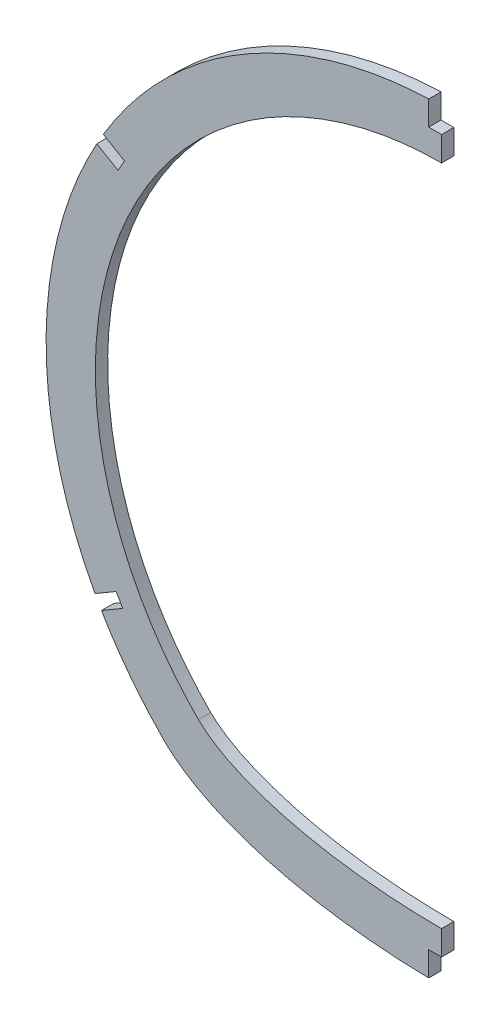
ISO-10303-21;
HEADER;
FILE_DESCRIPTION(('STEP AP214'),'2;1');
FILE_NAME('part.step','',(''),(''),'','','');
FILE_SCHEMA(('AUTOMOTIVE_DESIGN { 1 0 10303 214 1 1 1 1 }'));
ENDSEC;
DATA;
#1=APPLICATION_CONTEXT('core data for automotive mechanical design processes');
#2=APPLICATION_PROTOCOL_DEFINITION('international standard','automotive_design',2000,#1);
#3=PRODUCT_CONTEXT('',#1,'mechanical');
#4=PRODUCT('Part','Part','',(#3));
#5=PRODUCT_RELATED_PRODUCT_CATEGORY('part','',(#4));
#6=PRODUCT_DEFINITION_FORMATION('','',#4);
#7=PRODUCT_DEFINITION_CONTEXT('part definition',#1,'design');
#8=PRODUCT_DEFINITION('design','',#6,#7);
#9=PRODUCT_DEFINITION_SHAPE('','',#8);
#10=(LENGTH_UNIT() NAMED_UNIT(*) SI_UNIT(.MILLI.,.METRE.));
#11=(NAMED_UNIT(*) PLANE_ANGLE_UNIT() SI_UNIT($,.RADIAN.));
#12=(NAMED_UNIT(*) SI_UNIT($,.STERADIAN.) SOLID_ANGLE_UNIT());
#13=UNCERTAINTY_MEASURE_WITH_UNIT(LENGTH_MEASURE(1.E-05),#10,'distance_accuracy_value','');
#14=(GEOMETRIC_REPRESENTATION_CONTEXT(3) GLOBAL_UNCERTAINTY_ASSIGNED_CONTEXT((#13)) GLOBAL_UNIT_ASSIGNED_CONTEXT((#10,
#11,#12)) REPRESENTATION_CONTEXT('',''));
#15=CARTESIAN_POINT('',(0.,0.,0.));
#16=DIRECTION('',(0.,0.,1.));
#17=DIRECTION('',(1.,0.,0.));
#18=AXIS2_PLACEMENT_3D('',#15,#16,#17);
#19=CARTESIAN_POINT('',(49.5009150251778,91.3480347676851,-3.175));
#20=CARTESIAN_POINT('',(49.188310006463,91.524412895684,-3.175));
#21=CARTESIAN_POINT('',(48.5618108473245,91.8735190835381,-3.175));
#22=CARTESIAN_POINT('',(47.6826566420058,92.3513831690175,-3.175));
#23=CARTESIAN_POINT('',(46.7667227464734,92.8378491452977,-3.175));
#24=CARTESIAN_POINT('',(45.8466079607826,93.3142943038686,-3.175));
#25=CARTESIAN_POINT('',(44.9225493041904,93.7809177901616,-3.175));
#26=CARTESIAN_POINT('',(43.994622480106,94.2376340488833,-3.175));
#27=CARTESIAN_POINT('',(42.4432748698963,94.9816093987879,-3.175));
#28=CARTESIAN_POINT('',(39.9429438824299,96.118550992504,-3.175));
#29=CARTESIAN_POINT('',(36.45934876495,97.5551092489247,-3.175));
#30=CARTESIAN_POINT('',(32.6112816617896,98.961940132418,-3.175));
#31=CARTESIAN_POINT('',(28.7241978285818,100.207008268086,-3.175));
#32=CARTESIAN_POINT('',(24.8050353304667,101.289916540101,-3.175));
#33=CARTESIAN_POINT('',(20.8606758926356,102.210568115259,-3.175));
#34=CARTESIAN_POINT('',(16.8979328914549,102.96916021327,-3.175));
#35=CARTESIAN_POINT('',(12.9235364558735,103.566176285235,-3.175));
#36=CARTESIAN_POINT('',(8.94412924921375,104.002381093837,-3.175));
#37=CARTESIAN_POINT('',(5.29592070630354,104.255895367686,-3.175));
#38=CARTESIAN_POINT('',(2.64468898430357,104.347784007784,-3.175));
#39=CARTESIAN_POINT('',(0.991105150160322,104.372307847745,-3.175));
#40=CARTESIAN_POINT('',(-3.65694174832626,104.395312688799,-3.175));
#41=CARTESIAN_POINT('',(-12.0294965627891,103.894248368432,-3.175));
#42=CARTESIAN_POINT('',(-24.000842482084,101.716725173513,-3.175));
#43=CARTESIAN_POINT('',(-35.7904996479663,98.052224226085,-3.175));
#44=CARTESIAN_POINT('',(-47.2020288848494,92.8989668357338,-3.175));
#45=CARTESIAN_POINT('',(-58.6369916032999,85.9148260962418,-3.175));
#46=CARTESIAN_POINT('',(-69.8712448207028,76.755385293212,-3.175));
#47=CARTESIAN_POINT('',(-80.0433671629454,65.5541464838692,-3.175));
#48=CARTESIAN_POINT('',(-88.656512854058,52.7081207513875,-3.175));
#49=CARTESIAN_POINT('',(-94.9477876275601,39.4775915957048,-3.175));
#50=CARTESIAN_POINT('',(-99.5817152647422,24.7033927894236,-3.175));
#51=CARTESIAN_POINT('',(-101.637583470158,11.9166161834522,-3.175));
#52=CARTESIAN_POINT('',(-102.055561508796,1.05564464694755,-3.175));
#53=CARTESIAN_POINT('',(-101.805900705101,-6.10847144893243,-3.175));
#54=CARTESIAN_POINT('',(-101.217383692121,-12.1158216609889,-3.175));
#55=CARTESIAN_POINT('',(-100.4843781062,-16.9734792239715,-3.175));
#56=CARTESIAN_POINT('',(-99.4165681133501,-22.4926511017455,-3.175));
#57=CARTESIAN_POINT('',(-97.8067776153171,-28.8547901922303,-3.175));
#58=CARTESIAN_POINT('',(-95.3516338001493,-36.1751584408927,-3.175));
#59=CARTESIAN_POINT('',(-92.5499221794144,-42.8913874243363,-3.175));
#60=CARTESIAN_POINT('',(-90.1147287382659,-47.7724368106105,-3.175));
#61=CARTESIAN_POINT('',(-88.2859114265374,-51.0701314882498,-3.175));
#62=CARTESIAN_POINT('',(-87.1622182537815,-52.9973355617063,-3.175));
#63=CARTESIAN_POINT('',(-85.6295668087907,-55.5014033934274,-3.175));
#64=CARTESIAN_POINT('',(-83.6416121299898,-58.5296735477416,-3.175));
#65=CARTESIAN_POINT('',(-81.5476082197693,-61.4464285751036,-3.175));
#66=CARTESIAN_POINT('',(-79.8244327389292,-63.6962461401433,-3.175));
#67=CARTESIAN_POINT('',(-78.5156774789072,-65.3347298757925,-3.175));
#68=CARTESIAN_POINT('',(-77.1860844080194,-66.9318970671788,-3.175));
#69=CARTESIAN_POINT('',(-75.8371829959084,-68.4880433907376,-3.175));
#70=CARTESIAN_POINT('',(-74.4695911517312,-70.0026167179504,-3.175));
#71=CARTESIAN_POINT('',(-72.9728720426122,-71.5936149576732,-3.175));
#72=CARTESIAN_POINT('',(-72.1092424557216,-72.4766598998388,-3.175));
#73=CARTESIAN_POINT('',(-71.6773921121829,-72.9104343401338,-3.175));
#74=B_SPLINE_CURVE_WITH_KNOTS('',3,(#19,#20,#21,#22,#23,#24,#25,#26,#27,#28,#29,#30,#31,#32,#33,
#34,#35,#36,#37,#38,#39,#40,#41,#42,#43,#44,#45,#46,#47,#48,#49,#50,#51,#52,#53,#54,#55,#56,#57,
#58,#59,#60,#61,#62,#63,#64,#65,#66,#67,#68,#69,#70,#71,#72,#73),.UNSPECIFIED.,.F.,.F.,(4,1,1,1,
1,1,1,1,1,1,1,1,1,1,1,1,1,1,1,1,1,1,1,1,1,1,1,1,1,1,1,1,1,1,1,1,1,1,1,1,1,1,1,1,1,1,1,1,1,1,1,1,
4),(0.,0.00352437458249677,0.00704550992716724,0.0105634021822071,0.0140780475646078,
0.0175894423601658,0.0210975829234911,0.0246024656780182,0.0350975323557623,0.0490451403405747,
0.0629402066309289,0.0767825486341157,0.0905720014336864,0.104308417815624,0.117991668298819,
0.131621641169948,0.145198242522837,0.158721396302384,0.168828651008425,0.172191044353109,
0.175550090989136,0.216129638163983,0.257308764632856,0.29908424231982,0.341451040989245,
0.384402349198282,0.435091838106235,0.488423669435511,0.537764879321746,0.591988685841937,
0.636884123367178,0.694967908668103,0.723114204060167,0.747400057312873,0.767855597522932,
0.784506363330433,0.79737323013838,0.825052292918551,0.851215013836186,0.875875713992295,
0.899047960667383,0.906680341391375,0.914246931011726,0.921747968487533,0.936554336342276,
0.951101330761206,0.958278146675198,0.965390817215622,0.972439572459694,0.979424641272596,
0.986346251326181,0.993204629119325,1.),.UNSPECIFIED.);
#75=DIRECTION('',(0.,0.,1.));
#76=VECTOR('',#75,1.);
#77=SURFACE_OF_LINEAR_EXTRUSION('',#74,#76);
#78=DIRECTION('',(0.,0.,1.));
#79=VECTOR('',#78,1.);
#80=CARTESIAN_POINT('',(-3.302,104.32099877481,-3.175));
#81=LINE('',#80,#79);
#82=CARTESIAN_POINT('',(-3.302,104.320999866015,-3.175));
#83=VERTEX_POINT('',#82);
#84=CARTESIAN_POINT('',(-3.302,104.320997779388,0.));
#85=VERTEX_POINT('',#84);
#86=EDGE_CURVE('E197',#83,#85,#81,.T.);
#87=ORIENTED_EDGE('',*,*,#86,.F.);
#88=CARTESIAN_POINT('',(-3.30199996399451,104.320998775999,-3.175));
#89=CARTESIAN_POINT('',(-6.1887421865788,104.225643688862,-3.175));
#90=CARTESIAN_POINT('',(-13.1149866012071,103.696803590506,-3.175));
#91=CARTESIAN_POINT('',(-24.000842482084,101.716725173513,-3.175));
#92=CARTESIAN_POINT('',(-35.7904996479663,98.052224226085,-3.175));
#93=CARTESIAN_POINT('',(-47.2020288848494,92.8989668357338,-3.175));
#94=CARTESIAN_POINT('',(-58.6369916032999,85.9148260962418,-3.175));
#95=CARTESIAN_POINT('',(-69.8712448207028,76.755385293212,-3.175));
#96=CARTESIAN_POINT('',(-79.64638167187,65.9912951082928,-3.175));
#97=CARTESIAN_POINT('',(-85.0186644951895,58.1247366852491,-3.175));
#98=CARTESIAN_POINT('',(-87.2025968239922,54.462141005346,-3.175));
#99=B_SPLINE_CURVE_WITH_KNOTS('',3,(#88,#89,#90,#91,#92,#93,#94,#95,#96,#97,#98),.UNSPECIFIED.,
.F.,.F.,(4,1,1,1,1,1,1,1,4),(0.186751428881957,0.216129638163983,0.257308764632856,
0.29908424231982,0.341451040989245,0.384402349198282,0.435091838106235,0.488423669435511,
0.531779628920186),.UNSPECIFIED.);
#100=CARTESIAN_POINT('',(-87.2025963257135,54.4621407082328,-3.175));
#101=VERTEX_POINT('',#100);
#102=EDGE_CURVE('E292',#83,#101,#99,.T.);
#103=ORIENTED_EDGE('',*,*,#102,.T.);
#104=DIRECTION('',(0.,0.,1.));
#105=VECTOR('',#104,1.);
#106=CARTESIAN_POINT('',(-87.2025968260629,54.4621410018733,-3.175));
#107=LINE('',#106,#105);
#108=CARTESIAN_POINT('',(-87.2025975812884,54.4621414450931,0.));
#109=VERTEX_POINT('',#108);
#110=EDGE_CURVE('E385',#109,#101,#107,.F.);
#111=ORIENTED_EDGE('',*,*,#110,.F.);
#112=CARTESIAN_POINT('',(-87.2025968291873,54.4621409966336,0.));
#113=CARTESIAN_POINT('',(-85.0186644990099,58.1247366796551,0.));
#114=CARTESIAN_POINT('',(-79.6463816741502,65.9912951057819,0.));
#115=CARTESIAN_POINT('',(-69.8712448207028,76.755385293212,0.));
#116=CARTESIAN_POINT('',(-58.6369916032999,85.9148260962418,0.));
#117=CARTESIAN_POINT('',(-47.2020288848494,92.8989668357338,0.));
#118=CARTESIAN_POINT('',(-35.7904996479663,98.052224226085,0.));
#119=CARTESIAN_POINT('',(-24.000842482084,101.716725173513,0.));
#120=CARTESIAN_POINT('',(-13.1149866238415,103.696803586389,0.));
#121=CARTESIAN_POINT('',(-6.18874223243508,104.225643685361,0.));
#122=CARTESIAN_POINT('',(-3.30200003284659,104.320998773725,0.));
#123=B_SPLINE_CURVE_WITH_KNOTS('',3,(#112,#113,#114,#115,#116,#117,#118,#119,#120,#121,#122),
.UNSPECIFIED.,.F.,.F.,(4,1,1,1,1,1,1,1,4),(0.186751429115525,0.230107388634579,
0.283439219963854,0.334128708871807,0.377080017080844,0.41944681575027,0.461222293437233,
0.502401419906106,0.531779628954564),.UNSPECIFIED.);
#124=EDGE_CURVE('E220',#85,#109,#123,.F.);
#125=ORIENTED_EDGE('',*,*,#124,.F.);
#126=EDGE_LOOP('',(#87,#103,#111,#125));
#127=FACE_BOUND('',#126,.T.);
#128=ADVANCED_FACE('F36',(#127),#77,.T.);
#129=DIRECTION('',(0.,0.,1.));
#130=VECTOR('',#129,1.);
#131=CARTESIAN_POINT('',(-87.6873702731195,-52.0926713537194,-3.175));
#132=LINE('',#131,#130);
#133=CARTESIAN_POINT('',(-87.6873769214818,-52.0926752554494,-3.175));
#134=VERTEX_POINT('',#133);
#135=CARTESIAN_POINT('',(-87.6873837050129,-52.092679236506,0.));
#136=VERTEX_POINT('',#135);
#137=EDGE_CURVE('E423',#134,#136,#132,.T.);
#138=ORIENTED_EDGE('',*,*,#137,.F.);
#139=CARTESIAN_POINT('',(-87.6873702644737,-52.0926713685268,-3.175));
#140=CARTESIAN_POINT('',(-87.5104856725871,-52.3956159549457,-3.175));
#141=CARTESIAN_POINT('',(-86.9571670482185,-53.332351151444,-3.175));
#142=CARTESIAN_POINT('',(-85.6295668087907,-55.5014033934274,-3.175));
#143=CARTESIAN_POINT('',(-83.6416121299898,-58.5296735477416,-3.175));
#144=CARTESIAN_POINT('',(-81.5476082197693,-61.4464285751036,-3.175));
#145=CARTESIAN_POINT('',(-79.8244327389292,-63.6962461401433,-3.175));
#146=CARTESIAN_POINT('',(-78.5156774789072,-65.3347298757925,-3.175));
#147=CARTESIAN_POINT('',(-77.1860844080194,-66.9318970671788,-3.175));
#148=CARTESIAN_POINT('',(-75.8371829959084,-68.4880433907376,-3.175));
#149=CARTESIAN_POINT('',(-74.4695911517312,-70.0026167179504,-3.175));
#150=CARTESIAN_POINT('',(-72.9728720426122,-71.5936149576732,-3.175));
#151=CARTESIAN_POINT('',(-72.1092424557216,-72.4766598998388,-3.175));
#152=CARTESIAN_POINT('',(-71.6773921121829,-72.9104343401338,-3.175));
#153=B_SPLINE_CURVE_WITH_KNOTS('',3,(#139,#140,#141,#142,#143,#144,#145,#146,#147,#148,#149,
#150,#151,#152),.UNSPECIFIED.,.F.,.F.,(4,1,1,1,1,1,1,1,1,1,1,4),(0.910677139684742,
0.914246931011726,0.921747968487533,0.936554336342276,0.951101330761206,0.958278146675198,
0.965390817215622,0.972439572459694,0.979424641272596,0.986346251326181,0.993204629119325,1.),.UNSPECIFIED.);
#154=CARTESIAN_POINT('',(-71.6773921121829,-72.9104343401338,-3.175));
#155=VERTEX_POINT('',#154);
#156=EDGE_CURVE('E307',#134,#155,#153,.T.);
#157=ORIENTED_EDGE('',*,*,#156,.T.);
#158=DIRECTION('',(0.,0.,1.));
#159=VECTOR('',#158,1.);
#160=CARTESIAN_POINT('',(-71.6773921121829,-72.9104343401338,-3.175));
#161=LINE('',#160,#159);
#162=CARTESIAN_POINT('',(-71.6773921121829,-72.9104343401338,0.));
#163=VERTEX_POINT('',#162);
#164=EDGE_CURVE('E366',#155,#163,#161,.T.);
#165=ORIENTED_EDGE('',*,*,#164,.T.);
#166=CARTESIAN_POINT('',(-71.6773921121829,-72.9104343401338,0.));
#167=CARTESIAN_POINT('',(-72.1092424557216,-72.4766598998388,0.));
#168=CARTESIAN_POINT('',(-72.9728720426122,-71.5936149576732,0.));
#169=CARTESIAN_POINT('',(-74.4695911517312,-70.0026167179504,0.));
#170=CARTESIAN_POINT('',(-75.8371829959084,-68.4880433907376,0.));
#171=CARTESIAN_POINT('',(-77.1860844080194,-66.9318970671788,0.));
#172=CARTESIAN_POINT('',(-78.5156774789072,-65.3347298757925,0.));
#173=CARTESIAN_POINT('',(-79.8244327389292,-63.6962461401433,0.));
#174=CARTESIAN_POINT('',(-81.5476082197693,-61.4464285751036,0.));
#175=CARTESIAN_POINT('',(-83.6416121299898,-58.5296735477416,0.));
#176=CARTESIAN_POINT('',(-85.6295668087907,-55.5014033934274,0.));
#177=CARTESIAN_POINT('',(-86.9571670451952,-53.3323511563835,0.));
#178=CARTESIAN_POINT('',(-87.5104856666965,-52.395615964918,0.));
#179=CARTESIAN_POINT('',(-87.6873702557138,-52.0926713835295,0.));
#180=B_SPLINE_CURVE_WITH_KNOTS('',3,(#166,#167,#168,#169,#170,#171,#172,#173,#174,#175,#176,
#177,#178,#179),.UNSPECIFIED.,.F.,.F.,(4,1,1,1,1,1,1,1,1,1,1,4),(0.910677139743671,
0.917472510624346,0.92433088841749,0.931252498471075,0.938237567283977,0.945286322528049,
0.952398993068473,0.959575808982465,0.974122803401396,0.988929171256139,0.996430208731946,1.),.UNSPECIFIED.);
#181=EDGE_CURVE('E315',#136,#163,#180,.F.);
#182=ORIENTED_EDGE('',*,*,#181,.F.);
#183=EDGE_LOOP('',(#138,#157,#165,#182));
#184=FACE_BOUND('',#183,.T.);
#185=ADVANCED_FACE('F373',(#184),#77,.T.);
#186=CARTESIAN_POINT('',(-71.6773904357331,-72.9104326711204,-3.175));
#187=CARTESIAN_POINT('',(-46.3588938812152,-98.3417346380853,-3.175));
#188=CARTESIAN_POINT('',(46.3599287944268,-98.3417346380853,-3.175));
#189=CARTESIAN_POINT('',(71.6784253489449,-72.9104326711204,-3.175));
#190=(BOUNDED_CURVE() B_SPLINE_CURVE(3,(#186,#187,#188,#189),.UNSPECIFIED.,.F.,
.F.) B_SPLINE_CURVE_WITH_KNOTS((4,4),(0.,1.),
.UNSPECIFIED.) CURVE() GEOMETRIC_REPRESENTATION_ITEM() RATIONAL_B_SPLINE_CURVE((1.,1.,1.,1.)) REPRESENTATION_ITEM(''));
#191=DIRECTION('',(0.,0.,1.));
#192=VECTOR('',#191,1.);
#193=SURFACE_OF_LINEAR_EXTRUSION('',#190,#192);
#194=DIRECTION('',(0.,0.,1.));
#195=VECTOR('',#194,1.);
#196=CARTESIAN_POINT('',(-3.30199999999999,-91.9573515280309,-3.175));
#197=LINE('',#196,#195);
#198=CARTESIAN_POINT('',(-3.30199969626299,-91.9574080758496,0.));
#199=VERTEX_POINT('',#198);
#200=CARTESIAN_POINT('',(-3.302,-91.957391550955,-3.175));
#201=VERTEX_POINT('',#200);
#202=EDGE_CURVE('E375',#199,#201,#197,.F.);
#203=ORIENTED_EDGE('',*,*,#202,.F.);
#204=CARTESIAN_POINT('',(-3.30199878609864,-91.9573515475647,0.));
#205=CARTESIAN_POINT('',(-31.6876117118282,-91.5005764367765,0.));
#206=CARTESIAN_POINT('',(-59.4905176873826,-85.1516034779618,0.));
#207=CARTESIAN_POINT('',(-71.6773904357331,-72.9104326711204,0.));
#208=(BOUNDED_CURVE() B_SPLINE_CURVE(3,(#204,#205,#206,#207),.UNSPECIFIED.,.F.,
.F.) B_SPLINE_CURVE_WITH_KNOTS((4,4),(0.,0.481342670648265),
.UNSPECIFIED.) CURVE() GEOMETRIC_REPRESENTATION_ITEM() RATIONAL_B_SPLINE_CURVE((1.,1.,1.,1.)) REPRESENTATION_ITEM(''));
#209=EDGE_CURVE('E266',#163,#199,#208,.F.);
#210=ORIENTED_EDGE('',*,*,#209,.F.);
#211=ORIENTED_EDGE('',*,*,#164,.F.);
#212=CARTESIAN_POINT('',(-71.6773904357331,-72.9104326711204,-3.175));
#213=CARTESIAN_POINT('',(-59.4905176768145,-85.151603488577,-3.175));
#214=CARTESIAN_POINT('',(-31.6876116636085,-91.5005764477878,-3.175));
#215=CARTESIAN_POINT('',(-3.30199871225311,-91.957351548753,-3.175));
#216=(BOUNDED_CURVE() B_SPLINE_CURVE(3,(#212,#213,#214,#215),.UNSPECIFIED.,.F.,
.F.) B_SPLINE_CURVE_WITH_KNOTS((4,4),(0.,0.481342671065671),
.UNSPECIFIED.) CURVE() GEOMETRIC_REPRESENTATION_ITEM() RATIONAL_B_SPLINE_CURVE((1.,1.,1.,1.)) REPRESENTATION_ITEM(''));
#217=EDGE_CURVE('E308',#155,#201,#216,.T.);
#218=ORIENTED_EDGE('',*,*,#217,.T.);
#219=EDGE_LOOP('',(#203,#210,#211,#218));
#220=FACE_BOUND('',#219,.T.);
#221=ADVANCED_FACE('F245',(#220),#193,.T.);
#222=DIRECTION('',(0.,0.,1.));
#223=VECTOR('',#222,1.);
#224=CARTESIAN_POINT('',(-88.8854057560112,51.5327429038947,-3.175));
#225=LINE('',#224,#223);
#226=CARTESIAN_POINT('',(-88.8854234903048,51.5327533116346,-3.175));
#227=VERTEX_POINT('',#226);
#228=CARTESIAN_POINT('',(-88.885435442096,51.5327606670615,0.));
#229=VERTEX_POINT('',#228);
#230=EDGE_CURVE('E387',#227,#229,#225,.T.);
#231=ORIENTED_EDGE('',*,*,#230,.F.);
#232=CARTESIAN_POINT('',(-88.8854052479395,51.5327438225711,-3.175));
#233=CARTESIAN_POINT('',(-91.206648376539,47.3355584283914,-3.175));
#234=CARTESIAN_POINT('',(-95.1088540779152,38.9640687388794,-3.175));
#235=CARTESIAN_POINT('',(-99.5817152647422,24.7033927894236,-3.175));
#236=CARTESIAN_POINT('',(-101.637583470158,11.9166161834522,-3.175));
#237=CARTESIAN_POINT('',(-102.055561508796,1.05564464694755,-3.175));
#238=CARTESIAN_POINT('',(-101.805900705101,-6.10847144893243,-3.175));
#239=CARTESIAN_POINT('',(-101.217383692121,-12.1158216609889,-3.175));
#240=CARTESIAN_POINT('',(-100.4843781062,-16.9734792239715,-3.175));
#241=CARTESIAN_POINT('',(-99.4165681133501,-22.4926511017455,-3.175));
#242=CARTESIAN_POINT('',(-97.8067776153171,-28.8547901922303,-3.175));
#243=CARTESIAN_POINT('',(-95.3516338001493,-36.1751584408927,-3.175));
#244=CARTESIAN_POINT('',(-92.5499221794144,-42.8913874243363,-3.175));
#245=CARTESIAN_POINT('',(-90.4424592451194,-47.1155408276013,-3.175));
#246=CARTESIAN_POINT('',(-89.3512900510434,-49.1330795105141,-3.175));
#247=CARTESIAN_POINT('',(-89.3434414643635,-49.1475830766064,-3.175));
#248=B_SPLINE_CURVE_WITH_KNOTS('',3,(#232,#233,#234,#235,#236,#237,#238,#239,#240,#241,#242,
#243,#244,#245,#246,#247),.UNSPECIFIED.,.F.,.F.,(4,1,1,1,1,1,1,1,1,1,1,1,1,4),
(0.543228955566423,0.591988685841937,0.636884123367178,0.694967908668103,0.723114204060167,
0.747400057312873,0.767855597522932,0.784506363330433,0.79737323013838,0.825052292918551,
0.851215013836186,0.875875713992295,0.899047960667383,0.89921576810315),.UNSPECIFIED.);
#249=CARTESIAN_POINT('',(-89.3434572876108,-49.1475909425357,-3.175));
#250=VERTEX_POINT('',#249);
#251=EDGE_CURVE('E300',#227,#250,#248,.T.);
#252=ORIENTED_EDGE('',*,*,#251,.T.);
#253=DIRECTION('',(0.,0.,1.));
#254=VECTOR('',#253,1.);
#255=CARTESIAN_POINT('',(-89.3434420476878,-49.1475819986693,-3.175));
#256=LINE('',#255,#254);
#257=CARTESIAN_POINT('',(-89.3434591969204,-49.1475923313067,0.));
#258=VERTEX_POINT('',#257);
#259=EDGE_CURVE('E421',#258,#250,#256,.F.);
#260=ORIENTED_EDGE('',*,*,#259,.F.);
#261=CARTESIAN_POINT('',(-89.3434416071307,-49.1475828127839,0.));
#262=CARTESIAN_POINT('',(-89.3512901461799,-49.1330793346096,0.));
#263=CARTESIAN_POINT('',(-90.4424592897918,-47.115540738061,0.));
#264=CARTESIAN_POINT('',(-92.5499221794144,-42.8913874243363,0.));
#265=CARTESIAN_POINT('',(-95.3516338001493,-36.1751584408927,0.));
#266=CARTESIAN_POINT('',(-97.8067776153171,-28.8547901922303,0.));
#267=CARTESIAN_POINT('',(-99.4165681133501,-22.4926511017455,0.));
#268=CARTESIAN_POINT('',(-100.4843781062,-16.9734792239715,0.));
#269=CARTESIAN_POINT('',(-101.217383692121,-12.1158216609889,0.));
#270=CARTESIAN_POINT('',(-101.805900705101,-6.10847144893243,0.));
#271=CARTESIAN_POINT('',(-102.055561508796,1.05564464694755,0.));
#272=CARTESIAN_POINT('',(-101.637583470158,11.9166161834522,0.));
#273=CARTESIAN_POINT('',(-99.5817152647422,24.7033927894236,0.));
#274=CARTESIAN_POINT('',(-95.1088540651673,38.9640687795229,0.));
#275=CARTESIAN_POINT('',(-91.2066483405014,47.3355585057038,0.));
#276=CARTESIAN_POINT('',(-88.8854051861765,51.5327439342487,0.));
#277=B_SPLINE_CURVE_WITH_KNOTS('',3,(#261,#262,#263,#264,#265,#266,#267,#268,#269,#270,#271,
#272,#273,#274,#275,#276),.UNSPECIFIED.,.F.,.F.,(4,1,1,1,1,1,1,1,1,1,1,1,1,4),
(0.543228955133961,0.543396761552246,0.566569008227334,0.591229708383443,0.617392429301077,
0.645071492081249,0.657938358889196,0.674589124696697,0.695044664906755,0.719330518159462,
0.747476813551526,0.805560598852451,0.850456036377692,0.899215767085668),.UNSPECIFIED.);
#278=EDGE_CURVE('E313',#229,#258,#277,.F.);
#279=ORIENTED_EDGE('',*,*,#278,.F.);
#280=EDGE_LOOP('',(#231,#252,#260,#279));
#281=FACE_BOUND('',#280,.T.);
#282=ADVANCED_FACE('F38',(#281),#77,.T.);
#283=CARTESIAN_POINT('',(50.0565834934097,91.0320732131205,-3.175));
#284=DIRECTION('',(0.,0.,1.));
#285=DIRECTION('',(1.,0.,0.));
#286=AXIS2_PLACEMENT_3D('',#283,#284,#285);
#287=PLANE('',#286);
#288=ORIENTED_EDGE('',*,*,#102,.F.);
#289=DIRECTION('',(0.,1.,0.));
#290=VECTOR('',#289,1.);
#291=CARTESIAN_POINT('',(-3.302,98.0252029397284,-3.175));
#292=LINE('',#291,#290);
#293=CARTESIAN_POINT('',(-3.302,98.0252029397284,-3.175));
#294=VERTEX_POINT('',#293);
#295=EDGE_CURVE('E185',#294,#83,#292,.T.);
#296=ORIENTED_EDGE('',*,*,#295,.F.);
#297=DIRECTION('',(-1.,0.,0.));
#298=VECTOR('',#297,1.);
#299=CARTESIAN_POINT('',(0.,98.0252029397284,-3.175));
#300=LINE('',#299,#298);
#301=CARTESIAN_POINT('',(0.,98.0252029397284,-3.175));
#302=VERTEX_POINT('',#301);
#303=EDGE_CURVE('E169',#302,#294,#300,.T.);
#304=ORIENTED_EDGE('',*,*,#303,.F.);
#305=DIRECTION('',(0.,1.,0.));
#306=VECTOR('',#305,1.);
#307=CARTESIAN_POINT('',(0.,91.0320732131205,-3.175));
#308=LINE('',#307,#306);
#309=CARTESIAN_POINT('',(0.,91.6752029397285,-3.175));
#310=VERTEX_POINT('',#309);
#311=EDGE_CURVE('E183',#310,#302,#308,.T.);
#312=ORIENTED_EDGE('',*,*,#311,.F.);
#313=CARTESIAN_POINT('',(43.2581692186161,80.2882820266958,-3.175));
#314=CARTESIAN_POINT('',(42.959233617076,80.4569374935883,-3.175));
#315=CARTESIAN_POINT('',(42.347028640755,80.7976447917564,-3.175));
#316=CARTESIAN_POINT('',(41.2142712686981,81.4108167963963,-3.175));
#317=CARTESIAN_POINT('',(39.1021056252755,82.5103520515595,-3.175));
#318=CARTESIAN_POINT('',(34.8793749413982,84.5248456555191,-3.175));
#319=CARTESIAN_POINT('',(26.1202860312368,87.9965863056681,-3.175));
#320=CARTESIAN_POINT('',(13.0389631034943,91.1975144005371,-3.175));
#321=CARTESIAN_POINT('',(-3.09099493214275,92.1158903062605,-3.175));
#322=CARTESIAN_POINT('',(-24.4872357228507,89.3835193008114,-3.175));
#323=CARTESIAN_POINT('',(-49.623996273716,78.7088412746098,-3.175));
#324=CARTESIAN_POINT('',(-73.333390237805,55.9721183580477,-3.175));
#325=CARTESIAN_POINT('',(-87.6499419622251,26.3500889765237,-3.175));
#326=CARTESIAN_POINT('',(-90.3542774090619,-0.967371821331129,-3.175));
#327=CARTESIAN_POINT('',(-86.8107578953494,-22.3600381075824,-3.175));
#328=CARTESIAN_POINT('',(-82.3028781167588,-35.1354061600781,-3.175));
#329=CARTESIAN_POINT('',(-77.3945445411714,-44.7560574325028,-3.175));
#330=CARTESIAN_POINT('',(-73.8113504609192,-50.4690129605792,-3.175));
#331=CARTESIAN_POINT('',(-70.6481784432258,-54.8355054769149,-3.175));
#332=CARTESIAN_POINT('',(-68.5567881748647,-57.468052236258,-3.175));
#333=CARTESIAN_POINT('',(-66.8045749030548,-59.5274161978003,-3.175));
#334=CARTESIAN_POINT('',(-65.7039316106974,-60.7645697727023,-3.175));
#335=CARTESIAN_POINT('',(-64.753829553783,-61.7946225162067,-3.175));
#336=CARTESIAN_POINT('',(-64.0020595542867,-62.5921016689122,-3.175));
#337=CARTESIAN_POINT('',(-63.3217257332463,-63.2983423748288,-3.175));
#338=CARTESIAN_POINT('',(-62.895509203784,-63.7308766921148,-3.175));
#339=CARTESIAN_POINT('',(-62.6771970570945,-63.9501615222804,-3.175));
#340=B_SPLINE_CURVE_WITH_KNOTS('',3,(#313,#314,#315,#316,#317,#318,#319,#320,#321,#322,#323,
#324,#325,#326,#327,#328,#329,#330,#331,#332,#333,#334,#335,#336,#337,#338,#339),.UNSPECIFIED.,
.F.,.F.,(4,1,1,1,1,1,1,1,1,1,1,1,1,1,1,1,1,1,1,1,1,1,1,1,4),(0.,0.00390621680249181,
0.00781243360498352,0.0156248672099671,0.0312497344199342,0.0624994688398685,0.124998937679737,
0.187498406519606,0.249997875359474,0.374996813039211,0.499995750718948,0.624994688398685,
0.749993626078422,0.812493094918291,0.874992563758159,0.906242298178094,0.937492032598028,
0.953116899807995,0.968741767017962,0.976554200622946,0.984366634227929,0.988272851030421,
0.992179067832913,0.996085284635405,0.999991501437897),.UNSPECIFIED.);
#341=CARTESIAN_POINT('',(-62.6771971309211,-63.9501614481249,-3.175));
#342=VERTEX_POINT('',#341);
#343=EDGE_CURVE('E323',#310,#342,#340,.T.);
#344=ORIENTED_EDGE('',*,*,#343,.T.);
#345=CARTESIAN_POINT('',(-62.6771954544708,-63.9501597791119,-3.175));
#346=CARTESIAN_POINT('',(-62.4410755194273,-64.187331735811,-3.175));
#347=CARTESIAN_POINT('',(-61.9724304349569,-64.6321776334887,-3.175));
#348=CARTESIAN_POINT('',(-60.8472731895527,-65.5948941052262,-3.175));
#349=CARTESIAN_POINT('',(-59.1779089634404,-66.8258809525266,-3.175));
#350=CARTESIAN_POINT('',(-56.7364209553425,-68.3251513219567,-3.175));
#351=CARTESIAN_POINT('',(-52.9412988911063,-70.2888492796152,-3.175));
#352=CARTESIAN_POINT('',(-47.2599165601131,-72.5994885146245,-3.175));
#353=CARTESIAN_POINT('',(-39.2204315103748,-74.977986937053,-3.175));
#354=CARTESIAN_POINT('',(-30.2280115249701,-76.880115217091,-3.175));
#355=CARTESIAN_POINT('',(-17.3037504062604,-78.7217407646572,-3.175));
#356=CARTESIAN_POINT('',(0.00051745660583323,-79.6586880674687,-3.175));
#357=CARTESIAN_POINT('',(17.304785319472,-78.7217407646572,-3.175));
#358=CARTESIAN_POINT('',(30.2290464381818,-76.880115217091,-3.175));
#359=CARTESIAN_POINT('',(39.2214664235865,-74.977986937053,-3.175));
#360=CARTESIAN_POINT('',(47.2609514733249,-72.5994885146245,-3.175));
#361=CARTESIAN_POINT('',(52.942333804318,-70.2888492796152,-3.175));
#362=CARTESIAN_POINT('',(56.7374558685542,-68.3251513219567,-3.175));
#363=CARTESIAN_POINT('',(59.1789438766522,-66.8258809525266,-3.175));
#364=CARTESIAN_POINT('',(60.8483081027644,-65.5948941052262,-3.175));
#365=CARTESIAN_POINT('',(61.9734653481687,-64.6321776334887,-3.175));
#366=CARTESIAN_POINT('',(62.4421104326391,-64.187331735811,-3.175));
#367=CARTESIAN_POINT('',(62.6782303676827,-63.9501597791119,-3.175));
#368=B_SPLINE_CURVE_WITH_KNOTS('',3,(#345,#346,#347,#348,#349,#350,#351,#352,#353,#354,#355,
#356,#357,#358,#359,#360,#361,#362,#363,#364,#365,#366,#367),.UNSPECIFIED.,.F.,.F.,(4,1,1,1,1,1,
1,1,1,1,1,1,1,1,1,1,1,1,1,1,4),(0.,0.015625,0.03125,0.0625,0.09375,0.125,0.1875,0.25,0.3125,
0.375,0.5,0.625,0.6875,0.75,0.8125,0.875,0.90625,0.9375,0.96875,0.984375,1.),.UNSPECIFIED.);
#369=CARTESIAN_POINT('',(0.,-79.2839091456459,-3.175));
#370=VERTEX_POINT('',#369);
#371=EDGE_CURVE('E330',#342,#370,#368,.T.);
#372=ORIENTED_EDGE('',*,*,#371,.T.);
#373=CARTESIAN_POINT('',(0.,-85.6339091456459,-3.175));
#374=VERTEX_POINT('',#373);
#375=EDGE_CURVE('E206',#374,#370,#308,.T.);
#376=ORIENTED_EDGE('',*,*,#375,.F.);
#377=DIRECTION('',(1.,0.,0.));
#378=VECTOR('',#377,1.);
#379=CARTESIAN_POINT('',(0.,-85.6339091456459,-3.175));
#380=LINE('',#379,#378);
#381=CARTESIAN_POINT('',(-3.302,-85.6339091456459,-3.175));
#382=VERTEX_POINT('',#381);
#383=EDGE_CURVE('E449',#382,#374,#380,.T.);
#384=ORIENTED_EDGE('',*,*,#383,.F.);
#385=DIRECTION('',(0.,1.,0.));
#386=VECTOR('',#385,1.);
#387=CARTESIAN_POINT('',(-3.302,-85.6339091456459,-3.175));
#388=LINE('',#387,#386);
#389=EDGE_CURVE('E408',#201,#382,#388,.T.);
#390=ORIENTED_EDGE('',*,*,#389,.F.);
#391=ORIENTED_EDGE('',*,*,#217,.F.);
#392=ORIENTED_EDGE('',*,*,#156,.F.);
#393=DIRECTION('',(-0.862448039455019,-0.506145610709204,0.));
#394=VECTOR('',#393,1.);
#395=CARTESIAN_POINT('',(-82.1936374265117,-48.8685597092932,-3.175));
#396=LINE('',#395,#394);
#397=CARTESIAN_POINT('',(-82.1936374265117,-48.8685597092932,-3.175));
#398=VERTEX_POINT('',#397);
#399=EDGE_CURVE('E418',#398,#134,#396,.T.);
#400=ORIENTED_EDGE('',*,*,#399,.F.);
#401=DIRECTION('',(0.506145610709203,-0.86244803945502,0.));
#402=VECTOR('',#401,1.);
#403=CARTESIAN_POINT('',(-82.1936374265117,-48.8685597092932,-3.175));
#404=LINE('',#403,#402);
#405=CARTESIAN_POINT('',(-83.9034985286095,-45.9550377424062,-3.175));
#406=VERTEX_POINT('',#405);
#407=EDGE_CURVE('E405',#406,#398,#404,.T.);
#408=ORIENTED_EDGE('',*,*,#407,.F.);
#409=DIRECTION('',(0.86244803945502,0.506145610709203,0.));
#410=VECTOR('',#409,1.);
#411=CARTESIAN_POINT('',(-83.9034985286095,-45.9550377424062,-3.175));
#412=LINE('',#411,#410);
#413=EDGE_CURVE('E306',#250,#406,#412,.T.);
#414=ORIENTED_EDGE('',*,*,#413,.F.);
#415=ORIENTED_EDGE('',*,*,#251,.F.);
#416=DIRECTION('',(-0.862448040415488,0.506145609072612,0.));
#417=VECTOR('',#416,1.);
#418=CARTESIAN_POINT('',(-83.4319232544425,48.3322530274338,-3.175));
#419=LINE('',#418,#417);
#420=CARTESIAN_POINT('',(-83.4319232544425,48.3322530274338,-3.175));
#421=VERTEX_POINT('',#420);
#422=EDGE_CURVE('E304',#421,#227,#419,.T.);
#423=ORIENTED_EDGE('',*,*,#422,.F.);
#424=DIRECTION('',(-0.506145609072612,-0.862448040415488,0.));
#425=VECTOR('',#424,1.);
#426=CARTESIAN_POINT('',(-81.7220621578734,51.2457749975654,-3.175));
#427=LINE('',#426,#425);
#428=CARTESIAN_POINT('',(-81.7220621578734,51.2457749975654,-3.175));
#429=VERTEX_POINT('',#428);
#430=EDGE_CURVE('E397',#429,#421,#427,.T.);
#431=ORIENTED_EDGE('',*,*,#430,.F.);
#432=DIRECTION('',(0.862448040415488,-0.506145609072612,0.));
#433=VECTOR('',#432,1.);
#434=CARTESIAN_POINT('',(-81.7220621578734,51.2457749975654,-3.175));
#435=LINE('',#434,#433);
#436=EDGE_CURVE('E394',#101,#429,#435,.T.);
#437=ORIENTED_EDGE('',*,*,#436,.F.);
#438=EDGE_LOOP('',(#288,#296,#304,#312,#344,#372,#376,#384,#390,#391,#392,#400,#408,#414,#415,
#423,#431,#437));
#439=FACE_BOUND('',#438,.T.);
#440=ADVANCED_FACE('F182',(#439),#287,.F.);
#441=CARTESIAN_POINT('',(50.0565834934097,91.0320732131205,0.));
#442=DIRECTION('',(0.,0.,1.));
#443=DIRECTION('',(1.,0.,0.));
#444=AXIS2_PLACEMENT_3D('',#441,#442,#443);
#445=PLANE('',#444);
#446=DIRECTION('',(0.,-1.,0.));
#447=VECTOR('',#446,1.);
#448=CARTESIAN_POINT('',(-3.302,91.0320732131206,0.));
#449=LINE('',#448,#447);
#450=CARTESIAN_POINT('',(-3.302,98.0252029397284,0.));
#451=VERTEX_POINT('',#450);
#452=EDGE_CURVE('E11',#85,#451,#449,.T.);
#453=ORIENTED_EDGE('',*,*,#452,.F.);
#454=ORIENTED_EDGE('',*,*,#124,.T.);
#455=DIRECTION('',(-0.862448040415488,0.506145609072612,0.));
#456=VECTOR('',#455,1.);
#457=CARTESIAN_POINT('',(-1.07060057184556,3.91378369593226,0.));
#458=LINE('',#457,#456);
#459=CARTESIAN_POINT('',(-81.7220621578734,51.2457749975654,0.));
#460=VERTEX_POINT('',#459);
#461=EDGE_CURVE('E48',#460,#109,#458,.T.);
#462=ORIENTED_EDGE('',*,*,#461,.F.);
#463=DIRECTION('',(0.506145609072612,0.862448040415488,0.));
#464=VECTOR('',#463,1.);
#465=CARTESIAN_POINT('',(-30.5948780926181,138.364064514754,0.));
#466=LINE('',#465,#464);
#467=CARTESIAN_POINT('',(-83.4319232544425,48.3322530274338,0.));
#468=VERTEX_POINT('',#467);
#469=EDGE_CURVE('E471',#468,#460,#466,.T.);
#470=ORIENTED_EDGE('',*,*,#469,.F.);
#471=DIRECTION('',(0.862448040415488,-0.506145609072612,0.));
#472=VECTOR('',#471,1.);
#473=CARTESIAN_POINT('',(-2.78046166841466,1.00026172580066,0.));
#474=LINE('',#473,#472);
#475=EDGE_CURVE('E475',#229,#468,#474,.T.);
#476=ORIENTED_EDGE('',*,*,#475,.F.);
#477=ORIENTED_EDGE('',*,*,#278,.T.);
#478=DIRECTION('',(-0.86244803945502,-0.506145610709203,0.));
#479=VECTOR('',#478,1.);
#480=CARTESIAN_POINT('',(75.5364382967162,47.6156128986289,0.));
#481=LINE('',#480,#479);
#482=CARTESIAN_POINT('',(-83.9034985286096,-45.9550377424062,0.));
#483=VERTEX_POINT('',#482);
#484=EDGE_CURVE('E459',#483,#258,#481,.T.);
#485=ORIENTED_EDGE('',*,*,#484,.F.);
#486=DIRECTION('',(-0.506145610709203,0.86244803945502,0.));
#487=VECTOR('',#486,1.);
#488=CARTESIAN_POINT('',(-109.383353331916,-2.53857742791441,0.));
#489=LINE('',#488,#487);
#490=CARTESIAN_POINT('',(-82.1936374265117,-48.8685597092932,0.));
#491=VERTEX_POINT('',#490);
#492=EDGE_CURVE('E461',#491,#483,#489,.T.);
#493=ORIENTED_EDGE('',*,*,#492,.F.);
#494=DIRECTION('',(0.862448039455019,0.506145610709204,0.));
#495=VECTOR('',#494,1.);
#496=CARTESIAN_POINT('',(77.246299398814,44.7020909317421,0.));
#497=LINE('',#496,#495);
#498=EDGE_CURVE('E469',#136,#491,#497,.T.);
#499=ORIENTED_EDGE('',*,*,#498,.F.);
#500=ORIENTED_EDGE('',*,*,#181,.T.);
#501=ORIENTED_EDGE('',*,*,#209,.T.);
#502=DIRECTION('',(0.,-1.,0.));
#503=VECTOR('',#502,1.);
#504=CARTESIAN_POINT('',(-3.302,91.0320732131205,0.));
#505=LINE('',#504,#503);
#506=CARTESIAN_POINT('',(-3.302,-85.6339091456459,0.));
#507=VERTEX_POINT('',#506);
#508=EDGE_CURVE('E176',#507,#199,#505,.T.);
#509=ORIENTED_EDGE('',*,*,#508,.F.);
#510=DIRECTION('',(-1.,0.,0.));
#511=VECTOR('',#510,1.);
#512=CARTESIAN_POINT('',(50.0565834934097,-85.6339091456459,0.));
#513=LINE('',#512,#511);
#514=CARTESIAN_POINT('',(0.,-85.6339091456459,0.));
#515=VERTEX_POINT('',#514);
#516=EDGE_CURVE('E436',#515,#507,#513,.T.);
#517=ORIENTED_EDGE('',*,*,#516,.F.);
#518=DIRECTION('',(0.,1.,0.));
#519=VECTOR('',#518,1.);
#520=CARTESIAN_POINT('',(0.,91.0320732131205,0.));
#521=LINE('',#520,#519);
#522=CARTESIAN_POINT('',(0.,-79.2839091456459,0.));
#523=VERTEX_POINT('',#522);
#524=EDGE_CURVE('E195',#515,#523,#521,.T.);
#525=ORIENTED_EDGE('',*,*,#524,.T.);
#526=CARTESIAN_POINT('',(-62.6771954544708,-63.9501597791119,0.));
#527=CARTESIAN_POINT('',(-62.4410755194273,-64.187331735811,0.));
#528=CARTESIAN_POINT('',(-61.9724304349569,-64.6321776334887,0.));
#529=CARTESIAN_POINT('',(-60.8472731895527,-65.5948941052262,0.));
#530=CARTESIAN_POINT('',(-59.1779089634404,-66.8258809525266,0.));
#531=CARTESIAN_POINT('',(-56.7364209553425,-68.3251513219567,0.));
#532=CARTESIAN_POINT('',(-52.9412988911063,-70.2888492796152,0.));
#533=CARTESIAN_POINT('',(-47.2599165601131,-72.5994885146245,0.));
#534=CARTESIAN_POINT('',(-39.2204315103748,-74.977986937053,0.));
#535=CARTESIAN_POINT('',(-30.2280115249701,-76.880115217091,0.));
#536=CARTESIAN_POINT('',(-17.3037504062604,-78.7217407646572,0.));
#537=CARTESIAN_POINT('',(0.00051745660583323,-79.6586880674687,0.));
#538=CARTESIAN_POINT('',(17.304785319472,-78.7217407646572,0.));
#539=CARTESIAN_POINT('',(30.2290464381818,-76.880115217091,0.));
#540=CARTESIAN_POINT('',(39.2214664235865,-74.977986937053,0.));
#541=CARTESIAN_POINT('',(47.2609514733249,-72.5994885146245,0.));
#542=CARTESIAN_POINT('',(52.942333804318,-70.2888492796152,0.));
#543=CARTESIAN_POINT('',(56.7374558685542,-68.3251513219567,0.));
#544=CARTESIAN_POINT('',(59.1789438766522,-66.8258809525266,0.));
#545=CARTESIAN_POINT('',(60.8483081027644,-65.5948941052262,0.));
#546=CARTESIAN_POINT('',(61.9734653481687,-64.6321776334887,0.));
#547=CARTESIAN_POINT('',(62.4421104326391,-64.187331735811,0.));
#548=CARTESIAN_POINT('',(62.6782303676827,-63.9501597791119,0.));
#549=B_SPLINE_CURVE_WITH_KNOTS('',3,(#526,#527,#528,#529,#530,#531,#532,#533,#534,#535,#536,
#537,#538,#539,#540,#541,#542,#543,#544,#545,#546,#547,#548),.UNSPECIFIED.,.F.,.F.,(4,1,1,1,1,1,
1,1,1,1,1,1,1,1,1,1,1,1,1,1,4),(0.,0.015625,0.03125,0.0625,0.09375,0.125,0.1875,0.25,0.3125,
0.375,0.5,0.625,0.6875,0.75,0.8125,0.875,0.90625,0.9375,0.96875,0.984375,1.),.UNSPECIFIED.);
#550=CARTESIAN_POINT('',(-62.6771971309211,-63.9501614481249,0.));
#551=VERTEX_POINT('',#550);
#552=EDGE_CURVE('E209',#551,#523,#549,.T.);
#553=ORIENTED_EDGE('',*,*,#552,.F.);
#554=CARTESIAN_POINT('',(43.2581692186161,80.2882820266958,0.));
#555=CARTESIAN_POINT('',(42.959233617076,80.4569374935883,0.));
#556=CARTESIAN_POINT('',(42.347028640755,80.7976447917564,0.));
#557=CARTESIAN_POINT('',(41.2142712686981,81.4108167963963,0.));
#558=CARTESIAN_POINT('',(39.1021056252755,82.5103520515595,0.));
#559=CARTESIAN_POINT('',(34.8793749413982,84.5248456555191,0.));
#560=CARTESIAN_POINT('',(26.1202860312368,87.9965863056681,0.));
#561=CARTESIAN_POINT('',(13.0389631034943,91.1975144005371,0.));
#562=CARTESIAN_POINT('',(-3.09099493214275,92.1158903062605,0.));
#563=CARTESIAN_POINT('',(-24.4872357228507,89.3835193008114,0.));
#564=CARTESIAN_POINT('',(-49.623996273716,78.7088412746098,0.));
#565=CARTESIAN_POINT('',(-73.333390237805,55.9721183580477,0.));
#566=CARTESIAN_POINT('',(-87.6499419622251,26.3500889765237,0.));
#567=CARTESIAN_POINT('',(-90.3542774090619,-0.967371821331129,0.));
#568=CARTESIAN_POINT('',(-86.8107578953494,-22.3600381075824,0.));
#569=CARTESIAN_POINT('',(-82.3028781167588,-35.1354061600781,0.));
#570=CARTESIAN_POINT('',(-77.3945445411714,-44.7560574325028,0.));
#571=CARTESIAN_POINT('',(-73.8113504609192,-50.4690129605792,0.));
#572=CARTESIAN_POINT('',(-70.6481784432258,-54.8355054769149,0.));
#573=CARTESIAN_POINT('',(-68.5567881748647,-57.468052236258,0.));
#574=CARTESIAN_POINT('',(-66.8045749030548,-59.5274161978003,0.));
#575=CARTESIAN_POINT('',(-65.7039316106974,-60.7645697727023,0.));
#576=CARTESIAN_POINT('',(-64.753829553783,-61.7946225162067,0.));
#577=CARTESIAN_POINT('',(-64.0020595542867,-62.5921016689122,0.));
#578=CARTESIAN_POINT('',(-63.3217257332463,-63.2983423748288,0.));
#579=CARTESIAN_POINT('',(-62.895509203784,-63.7308766921148,0.));
#580=CARTESIAN_POINT('',(-62.6771970570945,-63.9501615222804,0.));
#581=B_SPLINE_CURVE_WITH_KNOTS('',3,(#554,#555,#556,#557,#558,#559,#560,#561,#562,#563,#564,
#565,#566,#567,#568,#569,#570,#571,#572,#573,#574,#575,#576,#577,#578,#579,#580),.UNSPECIFIED.,
.F.,.F.,(4,1,1,1,1,1,1,1,1,1,1,1,1,1,1,1,1,1,1,1,1,1,1,1,4),(0.,0.00390621680249181,
0.00781243360498352,0.0156248672099671,0.0312497344199342,0.0624994688398685,0.124998937679737,
0.187498406519606,0.249997875359474,0.374996813039211,0.499995750718948,0.624994688398685,
0.749993626078422,0.812493094918291,0.874992563758159,0.906242298178094,0.937492032598028,
0.953116899807995,0.968741767017962,0.976554200622946,0.984366634227929,0.988272851030421,
0.992179067832913,0.996085284635405,0.999991501437897),.UNSPECIFIED.);
#582=CARTESIAN_POINT('',(0.,91.6752029397285,0.));
#583=VERTEX_POINT('',#582);
#584=EDGE_CURVE('E333',#583,#551,#581,.T.);
#585=ORIENTED_EDGE('',*,*,#584,.F.);
#586=CARTESIAN_POINT('',(0.,98.0252029397284,0.));
#587=VERTEX_POINT('',#586);
#588=EDGE_CURVE('E192',#583,#587,#521,.T.);
#589=ORIENTED_EDGE('',*,*,#588,.T.);
#590=DIRECTION('',(1.,0.,0.));
#591=VECTOR('',#590,1.);
#592=CARTESIAN_POINT('',(50.0565834934097,98.0252029397284,0.));
#593=LINE('',#592,#591);
#594=EDGE_CURVE('E172',#451,#587,#593,.T.);
#595=ORIENTED_EDGE('',*,*,#594,.F.);
#596=EDGE_LOOP('',(#453,#454,#462,#470,#476,#477,#485,#493,#499,#500,#501,#509,#517,#525,#553,
#585,#589,#595));
#597=FACE_BOUND('',#596,.T.);
#598=ADVANCED_FACE('F234',(#597),#445,.T.);
#599=DIRECTION('',(0.,0.,1.));
#600=VECTOR('',#599,1.);
#601=SURFACE_OF_LINEAR_EXTRUSION('',#368,#600);
#602=DIRECTION('',(0.,0.,1.));
#603=VECTOR('',#602,1.);
#604=CARTESIAN_POINT('',(0.,-79.2839091456459,-3.175));
#605=LINE('',#604,#603);
#606=EDGE_CURVE('E191',#370,#523,#605,.T.);
#607=ORIENTED_EDGE('',*,*,#606,.F.);
#608=ORIENTED_EDGE('',*,*,#371,.F.);
#609=DIRECTION('',(0.,0.,1.));
#610=VECTOR('',#609,1.);
#611=CARTESIAN_POINT('',(-62.6771971309211,-63.9501614481249,-3.175));
#612=LINE('',#611,#610);
#613=EDGE_CURVE('E319',#342,#551,#612,.T.);
#614=ORIENTED_EDGE('',*,*,#613,.T.);
#615=ORIENTED_EDGE('',*,*,#552,.T.);
#616=EDGE_LOOP('',(#607,#608,#614,#615));
#617=FACE_BOUND('',#616,.T.);
#618=ADVANCED_FACE('F242',(#617),#601,.F.);
#619=DIRECTION('',(0.,0.,1.));
#620=VECTOR('',#619,1.);
#621=SURFACE_OF_LINEAR_EXTRUSION('',#340,#620);
#622=DIRECTION('',(0.,0.,1.));
#623=VECTOR('',#622,1.);
#624=CARTESIAN_POINT('',(0.,91.6752029397285,-3.175));
#625=LINE('',#624,#623);
#626=EDGE_CURVE('E190',#583,#310,#625,.F.);
#627=ORIENTED_EDGE('',*,*,#626,.F.);
#628=ORIENTED_EDGE('',*,*,#584,.T.);
#629=ORIENTED_EDGE('',*,*,#613,.F.);
#630=ORIENTED_EDGE('',*,*,#343,.F.);
#631=EDGE_LOOP('',(#627,#628,#629,#630));
#632=FACE_BOUND('',#631,.T.);
#633=ADVANCED_FACE('F516',(#632),#621,.F.);
#634=CARTESIAN_POINT('',(0.,0.,0.));
#635=DIRECTION('',(1.,0.,0.));
#636=DIRECTION('',(0.,0.,-1.));
#637=AXIS2_PLACEMENT_3D('',#634,#635,#636);
#638=PLANE('',#637);
#639=DIRECTION('',(0.,0.,-1.));
#640=VECTOR('',#639,1.);
#641=CARTESIAN_POINT('',(0.,98.0252029397284,0.));
#642=LINE('',#641,#640);
#643=EDGE_CURVE('E165',#587,#302,#642,.T.);
#644=ORIENTED_EDGE('',*,*,#643,.F.);
#645=ORIENTED_EDGE('',*,*,#588,.F.);
#646=ORIENTED_EDGE('',*,*,#626,.T.);
#647=ORIENTED_EDGE('',*,*,#311,.T.);
#648=EDGE_LOOP('',(#644,#645,#646,#647));
#649=FACE_BOUND('',#648,.T.);
#650=ADVANCED_FACE('F188',(#649),#638,.T.);
#651=DIRECTION('',(0.,0.,1.));
#652=VECTOR('',#651,1.);
#653=CARTESIAN_POINT('',(0.,-85.6339091456459,0.));
#654=LINE('',#653,#652);
#655=EDGE_CURVE('E177',#374,#515,#654,.T.);
#656=ORIENTED_EDGE('',*,*,#655,.F.);
#657=ORIENTED_EDGE('',*,*,#375,.T.);
#658=ORIENTED_EDGE('',*,*,#606,.T.);
#659=ORIENTED_EDGE('',*,*,#524,.F.);
#660=EDGE_LOOP('',(#656,#657,#658,#659));
#661=FACE_BOUND('',#660,.T.);
#662=ADVANCED_FACE('F513',(#661),#638,.T.);
#663=CARTESIAN_POINT('',(0.,-85.6339091456459,0.00502983140840147));
#664=DIRECTION('',(0.,1.,0.));
#665=DIRECTION('',(0.,0.,1.));
#666=AXIS2_PLACEMENT_3D('',#663,#664,#665);
#667=PLANE('',#666);
#668=ORIENTED_EDGE('',*,*,#516,.T.);
#669=DIRECTION('',(0.,0.,-1.));
#670=VECTOR('',#669,1.);
#671=CARTESIAN_POINT('',(-3.302,-85.6339091456459,0.00502983140840147));
#672=LINE('',#671,#670);
#673=EDGE_CURVE('E450',#507,#382,#672,.T.);
#674=ORIENTED_EDGE('',*,*,#673,.T.);
#675=ORIENTED_EDGE('',*,*,#383,.T.);
#676=ORIENTED_EDGE('',*,*,#655,.T.);
#677=EDGE_LOOP('',(#668,#674,#675,#676));
#678=FACE_BOUND('',#677,.T.);
#679=ADVANCED_FACE('F455',(#678),#667,.F.);
#680=CARTESIAN_POINT('',(-3.302,-85.6339091456459,0.00502983140840147));
#681=DIRECTION('',(-1.,0.,0.));
#682=DIRECTION('',(0.,0.,1.));
#683=AXIS2_PLACEMENT_3D('',#680,#681,#682);
#684=PLANE('',#683);
#685=ORIENTED_EDGE('',*,*,#202,.T.);
#686=ORIENTED_EDGE('',*,*,#389,.T.);
#687=ORIENTED_EDGE('',*,*,#673,.F.);
#688=ORIENTED_EDGE('',*,*,#508,.T.);
#689=EDGE_LOOP('',(#685,#686,#687,#688));
#690=FACE_BOUND('',#689,.T.);
#691=ADVANCED_FACE('F445',(#690),#684,.F.);
#692=CARTESIAN_POINT('',(-3.302,98.0252029397284,0.00502983140840147));
#693=DIRECTION('',(-1.,0.,0.));
#694=DIRECTION('',(0.,-1.,0.));
#695=AXIS2_PLACEMENT_3D('',#692,#693,#694);
#696=PLANE('',#695);
#697=ORIENTED_EDGE('',*,*,#86,.T.);
#698=ORIENTED_EDGE('',*,*,#452,.T.);
#699=DIRECTION('',(0.,0.,-1.));
#700=VECTOR('',#699,1.);
#701=CARTESIAN_POINT('',(-3.302,98.0252029397284,0.00502983140840147));
#702=LINE('',#701,#700);
#703=EDGE_CURVE('E186',#451,#294,#702,.T.);
#704=ORIENTED_EDGE('',*,*,#703,.T.);
#705=ORIENTED_EDGE('',*,*,#295,.T.);
#706=EDGE_LOOP('',(#697,#698,#704,#705));
#707=FACE_BOUND('',#706,.T.);
#708=ADVANCED_FACE('F510',(#707),#696,.F.);
#709=CARTESIAN_POINT('',(0.,98.0252029397284,0.00502983140840147));
#710=DIRECTION('',(0.,-1.,0.));
#711=DIRECTION('',(0.,0.,-1.));
#712=AXIS2_PLACEMENT_3D('',#709,#710,#711);
#713=PLANE('',#712);
#714=ORIENTED_EDGE('',*,*,#594,.T.);
#715=ORIENTED_EDGE('',*,*,#643,.T.);
#716=ORIENTED_EDGE('',*,*,#303,.T.);
#717=ORIENTED_EDGE('',*,*,#703,.F.);
#718=EDGE_LOOP('',(#714,#715,#716,#717));
#719=FACE_BOUND('',#718,.T.);
#720=ADVANCED_FACE('F167',(#719),#713,.F.);
#721=CARTESIAN_POINT('',(-82.1936374265117,-48.8685597092932,0.00502983140840147));
#722=DIRECTION('',(0.506145610709204,-0.86244803945502,0.));
#723=DIRECTION('',(0.86244803945502,0.506145610709204,0.));
#724=AXIS2_PLACEMENT_3D('',#721,#722,#723);
#725=PLANE('',#724);
#726=ORIENTED_EDGE('',*,*,#137,.T.);
#727=ORIENTED_EDGE('',*,*,#498,.T.);
#728=DIRECTION('',(0.,0.,-1.));
#729=VECTOR('',#728,1.);
#730=CARTESIAN_POINT('',(-82.1936374265117,-48.8685597092932,0.00502983140840147));
#731=LINE('',#730,#729);
#732=EDGE_CURVE('E406',#491,#398,#731,.T.);
#733=ORIENTED_EDGE('',*,*,#732,.T.);
#734=ORIENTED_EDGE('',*,*,#399,.T.);
#735=EDGE_LOOP('',(#726,#727,#733,#734));
#736=FACE_BOUND('',#735,.T.);
#737=ADVANCED_FACE('F497',(#736),#725,.F.);
#738=CARTESIAN_POINT('',(-82.1936374265117,-48.8685597092932,0.00502983140840147));
#739=DIRECTION('',(0.86244803945502,0.506145610709203,0.));
#740=DIRECTION('',(-0.506145610709203,0.86244803945502,0.));
#741=AXIS2_PLACEMENT_3D('',#738,#739,#740);
#742=PLANE('',#741);
#743=ORIENTED_EDGE('',*,*,#492,.T.);
#744=DIRECTION('',(0.,0.,-1.));
#745=VECTOR('',#744,1.);
#746=CARTESIAN_POINT('',(-83.9034985286095,-45.9550377424062,0.00502983140840147));
#747=LINE('',#746,#745);
#748=EDGE_CURVE('E64',#483,#406,#747,.T.);
#749=ORIENTED_EDGE('',*,*,#748,.T.);
#750=ORIENTED_EDGE('',*,*,#407,.T.);
#751=ORIENTED_EDGE('',*,*,#732,.F.);
#752=EDGE_LOOP('',(#743,#749,#750,#751));
#753=FACE_BOUND('',#752,.T.);
#754=ADVANCED_FACE('F500',(#753),#742,.F.);
#755=CARTESIAN_POINT('',(-83.9034985286095,-45.9550377424062,0.00502983140840147));
#756=DIRECTION('',(-0.506145610709203,0.86244803945502,0.));
#757=DIRECTION('',(-0.86244803945502,-0.506145610709203,0.));
#758=AXIS2_PLACEMENT_3D('',#755,#756,#757);
#759=PLANE('',#758);
#760=ORIENTED_EDGE('',*,*,#259,.T.);
#761=ORIENTED_EDGE('',*,*,#413,.T.);
#762=ORIENTED_EDGE('',*,*,#748,.F.);
#763=ORIENTED_EDGE('',*,*,#484,.T.);
#764=EDGE_LOOP('',(#760,#761,#762,#763));
#765=FACE_BOUND('',#764,.T.);
#766=ADVANCED_FACE('F502',(#765),#759,.F.);
#767=CARTESIAN_POINT('',(-81.7220621578734,51.2457749975654,0.00502983140840147));
#768=DIRECTION('',(0.506145609072612,0.862448040415488,0.));
#769=DIRECTION('',(-0.862448040415488,0.506145609072612,0.));
#770=AXIS2_PLACEMENT_3D('',#767,#768,#769);
#771=PLANE('',#770);
#772=ORIENTED_EDGE('',*,*,#110,.T.);
#773=ORIENTED_EDGE('',*,*,#436,.T.);
#774=DIRECTION('',(0.,0.,-1.));
#775=VECTOR('',#774,1.);
#776=CARTESIAN_POINT('',(-81.7220621578734,51.2457749975654,0.00502983140840147));
#777=LINE('',#776,#775);
#778=EDGE_CURVE('E430',#460,#429,#777,.T.);
#779=ORIENTED_EDGE('',*,*,#778,.F.);
#780=ORIENTED_EDGE('',*,*,#461,.T.);
#781=EDGE_LOOP('',(#772,#773,#779,#780));
#782=FACE_BOUND('',#781,.T.);
#783=ADVANCED_FACE('F483',(#782),#771,.F.);
#784=CARTESIAN_POINT('',(-83.4319232544425,48.3322530274338,0.00502983140840147));
#785=DIRECTION('',(-0.506145609072612,-0.862448040415488,0.));
#786=DIRECTION('',(0.862448040415488,-0.506145609072612,0.));
#787=AXIS2_PLACEMENT_3D('',#784,#785,#786);
#788=PLANE('',#787);
#789=ORIENTED_EDGE('',*,*,#230,.T.);
#790=ORIENTED_EDGE('',*,*,#475,.T.);
#791=DIRECTION('',(0.,0.,-1.));
#792=VECTOR('',#791,1.);
#793=CARTESIAN_POINT('',(-83.4319232544425,48.3322530274338,0.00502983140840147));
#794=LINE('',#793,#792);
#795=EDGE_CURVE('E56',#468,#421,#794,.T.);
#796=ORIENTED_EDGE('',*,*,#795,.T.);
#797=ORIENTED_EDGE('',*,*,#422,.T.);
#798=EDGE_LOOP('',(#789,#790,#796,#797));
#799=FACE_BOUND('',#798,.T.);
#800=ADVANCED_FACE('F487',(#799),#788,.F.);
#801=CARTESIAN_POINT('',(-81.7220621578734,51.2457749975654,0.00502983140840147));
#802=DIRECTION('',(0.862448040415488,-0.506145609072612,0.));
#803=DIRECTION('',(0.506145609072612,0.862448040415488,0.));
#804=AXIS2_PLACEMENT_3D('',#801,#802,#803);
#805=PLANE('',#804);
#806=ORIENTED_EDGE('',*,*,#469,.T.);
#807=ORIENTED_EDGE('',*,*,#778,.T.);
#808=ORIENTED_EDGE('',*,*,#430,.T.);
#809=ORIENTED_EDGE('',*,*,#795,.F.);
#810=EDGE_LOOP('',(#806,#807,#808,#809));
#811=FACE_BOUND('',#810,.T.);
#812=ADVANCED_FACE('F485',(#811),#805,.F.);
#813=CLOSED_SHELL('',(#128,#185,#221,#282,#440,#598,#618,#633,#650,#662,#679,#691,#708,#720,
#737,#754,#766,#783,#800,#812));
#814=MANIFOLD_SOLID_BREP('B2',#813);
#815=ADVANCED_BREP_SHAPE_REPRESENTATION('',(#18,#814),#14);
#816=SHAPE_DEFINITION_REPRESENTATION(#9,#815);
ENDSEC;
END-ISO-10303-21;
